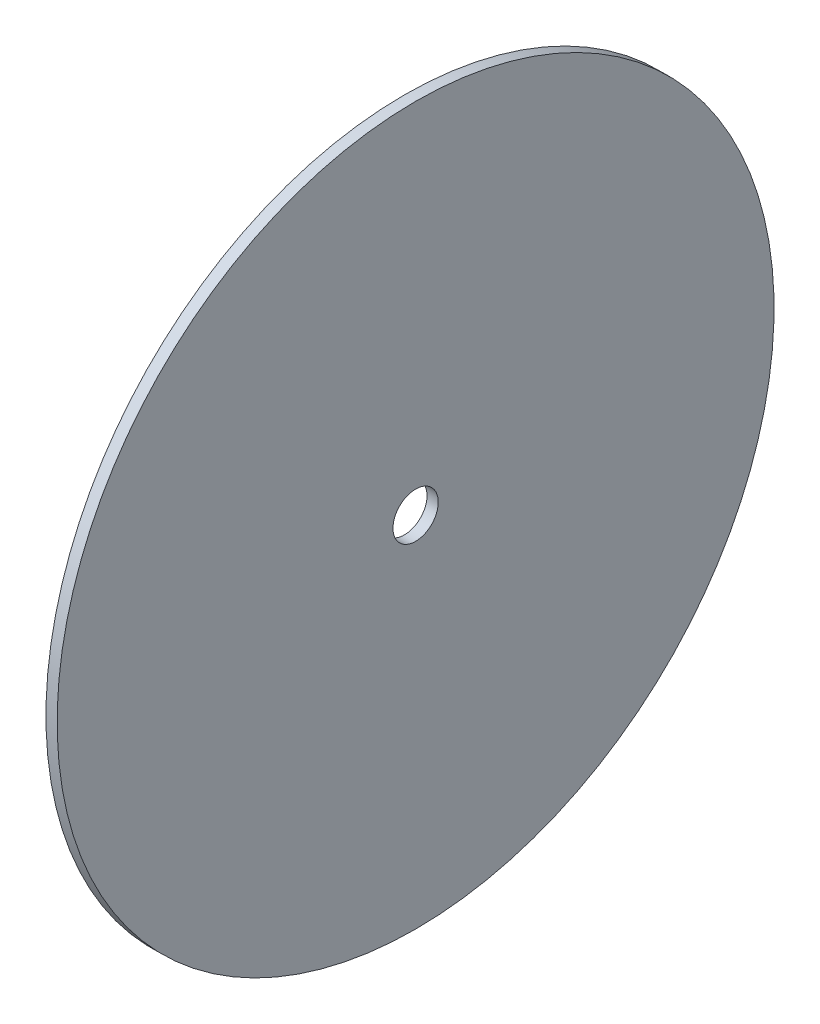
ISO-10303-21;
HEADER;
FILE_DESCRIPTION(('STEP AP214'),'2;1');
FILE_NAME('part.step','',(''),(''),'','','');
FILE_SCHEMA(('AUTOMOTIVE_DESIGN { 1 0 10303 214 1 1 1 1 }'));
ENDSEC;
DATA;
#1=APPLICATION_CONTEXT('core data for automotive mechanical design processes');
#2=APPLICATION_PROTOCOL_DEFINITION('international standard','automotive_design',2000,#1);
#3=PRODUCT_CONTEXT('',#1,'mechanical');
#4=PRODUCT('Part','Part','',(#3));
#5=PRODUCT_RELATED_PRODUCT_CATEGORY('part','',(#4));
#6=PRODUCT_DEFINITION_FORMATION('','',#4);
#7=PRODUCT_DEFINITION_CONTEXT('part definition',#1,'design');
#8=PRODUCT_DEFINITION('design','',#6,#7);
#9=PRODUCT_DEFINITION_SHAPE('','',#8);
#10=(LENGTH_UNIT() NAMED_UNIT(*) SI_UNIT(.MILLI.,.METRE.));
#11=(NAMED_UNIT(*) PLANE_ANGLE_UNIT() SI_UNIT($,.RADIAN.));
#12=(NAMED_UNIT(*) SI_UNIT($,.STERADIAN.) SOLID_ANGLE_UNIT());
#13=UNCERTAINTY_MEASURE_WITH_UNIT(LENGTH_MEASURE(1.E-05),#10,'distance_accuracy_value','');
#14=(GEOMETRIC_REPRESENTATION_CONTEXT(3) GLOBAL_UNCERTAINTY_ASSIGNED_CONTEXT((#13)) GLOBAL_UNIT_ASSIGNED_CONTEXT((#10,
#11,#12)) REPRESENTATION_CONTEXT('',''));
#15=CARTESIAN_POINT('',(0.,0.,0.));
#16=DIRECTION('',(0.,0.,1.));
#17=DIRECTION('',(1.,0.,0.));
#18=AXIS2_PLACEMENT_3D('',#15,#16,#17);
#19=CARTESIAN_POINT('',(485.,1.48488424396617E-13,0.));
#20=DIRECTION('',(1.,0.,0.));
#21=DIRECTION('',(0.,1.,0.));
#22=AXIS2_PLACEMENT_3D('',#19,#20,#21);
#23=PLANE('',#22);
#24=CARTESIAN_POINT('',(485.,1.48488424396617E-13,0.));
#25=DIRECTION('',(1.,0.,0.));
#26=DIRECTION('',(0.,1.,0.));
#27=AXIS2_PLACEMENT_3D('',#24,#25,#26);
#28=CIRCLE('',#27,160.);
#29=CARTESIAN_POINT('',(485.,160.,0.));
#30=VERTEX_POINT('',#29);
#31=EDGE_CURVE('E10',#30,#30,#28,.T.);
#32=ORIENTED_EDGE('',*,*,#31,.T.);
#33=EDGE_LOOP('',(#32));
#34=FACE_BOUND('',#33,.T.);
#35=CARTESIAN_POINT('',(485.,1.48488424396617E-13,0.));
#36=DIRECTION('',(1.,0.,0.));
#37=DIRECTION('',(0.,1.,0.));
#38=AXIS2_PLACEMENT_3D('',#35,#36,#37);
#39=CIRCLE('',#38,10.1000000000001);
#40=CARTESIAN_POINT('',(485.,10.1000000000002,0.));
#41=VERTEX_POINT('',#40);
#42=EDGE_CURVE('E54',#41,#41,#39,.T.);
#43=ORIENTED_EDGE('',*,*,#42,.F.);
#44=EDGE_LOOP('',(#43));
#45=FACE_BOUND('',#44,.T.);
#46=ADVANCED_FACE('F40',(#34,#45),#23,.T.);
#47=CARTESIAN_POINT('',(480.,1.46957615897682E-13,0.));
#48=DIRECTION('',(1.,0.,0.));
#49=DIRECTION('',(0.,1.,0.));
#50=AXIS2_PLACEMENT_3D('',#47,#48,#49);
#51=PLANE('',#50);
#52=CARTESIAN_POINT('',(480.,1.46957615897682E-13,0.));
#53=DIRECTION('',(1.,0.,0.));
#54=DIRECTION('',(0.,1.,0.));
#55=AXIS2_PLACEMENT_3D('',#52,#53,#54);
#56=CIRCLE('',#55,160.);
#57=CARTESIAN_POINT('',(480.,160.,0.));
#58=VERTEX_POINT('',#57);
#59=EDGE_CURVE('E44',#58,#58,#56,.T.);
#60=ORIENTED_EDGE('',*,*,#59,.F.);
#61=EDGE_LOOP('',(#60));
#62=FACE_BOUND('',#61,.T.);
#63=CARTESIAN_POINT('',(480.,1.46957615897682E-13,0.));
#64=DIRECTION('',(1.,0.,0.));
#65=DIRECTION('',(0.,1.,0.));
#66=AXIS2_PLACEMENT_3D('',#63,#64,#65);
#67=CIRCLE('',#66,10.1000000000001);
#68=CARTESIAN_POINT('',(480.,10.1000000000002,0.));
#69=VERTEX_POINT('',#68);
#70=EDGE_CURVE('E56',#69,#69,#67,.T.);
#71=ORIENTED_EDGE('',*,*,#70,.T.);
#72=EDGE_LOOP('',(#71));
#73=FACE_BOUND('',#72,.T.);
#74=ADVANCED_FACE('F69',(#62,#73),#51,.F.);
#75=CARTESIAN_POINT('',(485.,1.48488424396617E-13,0.));
#76=DIRECTION('',(-1.,0.,0.));
#77=DIRECTION('',(0.,-1.,0.));
#78=AXIS2_PLACEMENT_3D('',#75,#76,#77);
#79=CYLINDRICAL_SURFACE('',#78,160.);
#80=ORIENTED_EDGE('',*,*,#31,.F.);
#81=EDGE_LOOP('',(#80));
#82=FACE_BOUND('',#81,.T.);
#83=ORIENTED_EDGE('',*,*,#59,.T.);
#84=EDGE_LOOP('',(#83));
#85=FACE_BOUND('',#84,.T.);
#86=ADVANCED_FACE('F42',(#82,#85),#79,.T.);
#87=CARTESIAN_POINT('',(485.,1.48488424396617E-13,0.));
#88=DIRECTION('',(-1.,0.,0.));
#89=DIRECTION('',(0.,-1.,0.));
#90=AXIS2_PLACEMENT_3D('',#87,#88,#89);
#91=CYLINDRICAL_SURFACE('',#90,10.1000000000001);
#92=ORIENTED_EDGE('',*,*,#42,.T.);
#93=EDGE_LOOP('',(#92));
#94=FACE_BOUND('',#93,.T.);
#95=ORIENTED_EDGE('',*,*,#70,.F.);
#96=EDGE_LOOP('',(#95));
#97=FACE_BOUND('',#96,.T.);
#98=ADVANCED_FACE('F65',(#94,#97),#91,.F.);
#99=CLOSED_SHELL('',(#46,#74,#86,#98));
#100=MANIFOLD_SOLID_BREP('B2',#99);
#101=ADVANCED_BREP_SHAPE_REPRESENTATION('',(#18,#100),#14);
#102=SHAPE_DEFINITION_REPRESENTATION(#9,#101);
ENDSEC;
END-ISO-10303-21;
